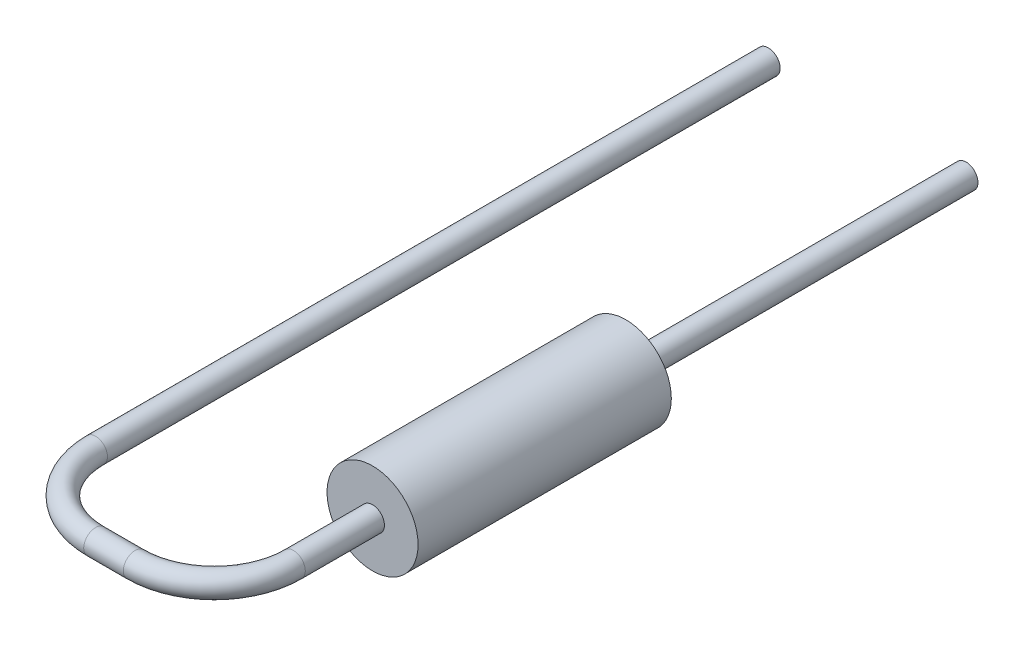
ISO-10303-21;
HEADER;
FILE_DESCRIPTION(('STEP AP214'),'2;1');
FILE_NAME('part.step','',(''),(''),'','','');
FILE_SCHEMA(('AUTOMOTIVE_DESIGN { 1 0 10303 214 1 1 1 1 }'));
ENDSEC;
DATA;
#1=APPLICATION_CONTEXT('core data for automotive mechanical design processes');
#2=APPLICATION_PROTOCOL_DEFINITION('international standard','automotive_design',2000,#1);
#3=PRODUCT_CONTEXT('',#1,'mechanical');
#4=PRODUCT('Part','Part','',(#3));
#5=PRODUCT_RELATED_PRODUCT_CATEGORY('part','',(#4));
#6=PRODUCT_DEFINITION_FORMATION('','',#4);
#7=PRODUCT_DEFINITION_CONTEXT('part definition',#1,'design');
#8=PRODUCT_DEFINITION('design','',#6,#7);
#9=PRODUCT_DEFINITION_SHAPE('','',#8);
#10=(LENGTH_UNIT() NAMED_UNIT(*) SI_UNIT(.MILLI.,.METRE.));
#11=(NAMED_UNIT(*) PLANE_ANGLE_UNIT() SI_UNIT($,.RADIAN.));
#12=(NAMED_UNIT(*) SI_UNIT($,.STERADIAN.) SOLID_ANGLE_UNIT());
#13=UNCERTAINTY_MEASURE_WITH_UNIT(LENGTH_MEASURE(1.E-05),#10,'distance_accuracy_value','');
#14=(GEOMETRIC_REPRESENTATION_CONTEXT(3) GLOBAL_UNCERTAINTY_ASSIGNED_CONTEXT((#13)) GLOBAL_UNIT_ASSIGNED_CONTEXT((#10,
#11,#12)) REPRESENTATION_CONTEXT('',''));
#15=CARTESIAN_POINT('',(0.,0.,0.));
#16=DIRECTION('',(0.,0.,1.));
#17=DIRECTION('',(1.,0.,0.));
#18=AXIS2_PLACEMENT_3D('',#15,#16,#17);
#19=CARTESIAN_POINT('',(0.,0.,0.));
#20=DIRECTION('',(0.,0.,1.));
#21=DIRECTION('',(1.,0.,0.));
#22=AXIS2_PLACEMENT_3D('',#19,#20,#21);
#23=PLANE('',#22);
#24=CARTESIAN_POINT('',(0.,0.,0.));
#25=DIRECTION('',(0.,0.,1.));
#26=DIRECTION('',(1.,0.,0.));
#27=AXIS2_PLACEMENT_3D('',#24,#25,#26);
#28=CIRCLE('',#27,1.15);
#29=CARTESIAN_POINT('',(1.15,0.,0.));
#30=VERTEX_POINT('',#29);
#31=EDGE_CURVE('E47',#30,#30,#28,.T.);
#32=ORIENTED_EDGE('',*,*,#31,.F.);
#33=EDGE_LOOP('',(#32));
#34=FACE_BOUND('',#33,.T.);
#35=CARTESIAN_POINT('',(0.,0.,0.));
#36=DIRECTION('',(0.,0.,1.));
#37=DIRECTION('',(1.,0.,0.));
#38=AXIS2_PLACEMENT_3D('',#35,#36,#37);
#39=CIRCLE('',#38,0.3);
#40=CARTESIAN_POINT('',(0.3,0.,0.));
#41=VERTEX_POINT('',#40);
#42=EDGE_CURVE('E10',#41,#41,#39,.F.);
#43=ORIENTED_EDGE('',*,*,#42,.F.);
#44=EDGE_LOOP('',(#43));
#45=FACE_BOUND('',#44,.T.);
#46=ADVANCED_FACE('F31',(#34,#45),#23,.F.);
#47=CARTESIAN_POINT('',(0.,0.,6.4));
#48=DIRECTION('',(0.,0.,-1.));
#49=DIRECTION('',(-1.,0.,0.));
#50=AXIS2_PLACEMENT_3D('',#47,#48,#49);
#51=CYLINDRICAL_SURFACE('',#50,1.15);
#52=CARTESIAN_POINT('',(0.,0.,6.4));
#53=DIRECTION('',(0.,0.,1.));
#54=DIRECTION('',(1.,0.,0.));
#55=AXIS2_PLACEMENT_3D('',#52,#53,#54);
#56=CIRCLE('',#55,1.15);
#57=CARTESIAN_POINT('',(1.15,0.,6.4));
#58=VERTEX_POINT('',#57);
#59=EDGE_CURVE('E42',#58,#58,#56,.T.);
#60=ORIENTED_EDGE('',*,*,#59,.F.);
#61=EDGE_LOOP('',(#60));
#62=FACE_BOUND('',#61,.T.);
#63=ORIENTED_EDGE('',*,*,#31,.T.);
#64=EDGE_LOOP('',(#63));
#65=FACE_BOUND('',#64,.T.);
#66=ADVANCED_FACE('F33',(#62,#65),#51,.T.);
#67=CARTESIAN_POINT('',(0.,0.,6.4));
#68=DIRECTION('',(0.,0.,1.));
#69=DIRECTION('',(1.,0.,0.));
#70=AXIS2_PLACEMENT_3D('',#67,#68,#69);
#71=PLANE('',#70);
#72=CARTESIAN_POINT('',(0.,0.,6.4));
#73=DIRECTION('',(0.,0.,1.));
#74=DIRECTION('',(1.,0.,0.));
#75=AXIS2_PLACEMENT_3D('',#72,#73,#74);
#76=CIRCLE('',#75,0.3);
#77=CARTESIAN_POINT('',(0.3,0.,6.4));
#78=VERTEX_POINT('',#77);
#79=EDGE_CURVE('E38',#78,#78,#76,.T.);
#80=ORIENTED_EDGE('',*,*,#79,.F.);
#81=EDGE_LOOP('',(#80));
#82=FACE_BOUND('',#81,.T.);
#83=ORIENTED_EDGE('',*,*,#59,.T.);
#84=EDGE_LOOP('',(#83));
#85=FACE_BOUND('',#84,.T.);
#86=ADVANCED_FACE('F73',(#82,#85),#71,.T.);
#87=CARTESIAN_POINT('',(-5.,0.,8.39999999999998));
#88=DIRECTION('',(0.,0.,-1.));
#89=DIRECTION('',(-1.,0.,0.));
#90=AXIS2_PLACEMENT_3D('',#87,#88,#89);
#91=CYLINDRICAL_SURFACE('',#90,0.3);
#92=CARTESIAN_POINT('',(-5.,0.,8.39999999999998));
#93=DIRECTION('',(0.,0.,-1.));
#94=DIRECTION('',(-1.,0.,0.));
#95=AXIS2_PLACEMENT_3D('',#92,#93,#94);
#96=CIRCLE('',#95,0.3);
#97=CARTESIAN_POINT('',(-5.3,0.,8.39999999999998));
#98=VERTEX_POINT('',#97);
#99=EDGE_CURVE('E59',#98,#98,#96,.T.);
#100=ORIENTED_EDGE('',*,*,#99,.T.);
#101=EDGE_LOOP('',(#100));
#102=FACE_BOUND('',#101,.T.);
#103=CARTESIAN_POINT('',(-5.,0.,-8.6));
#104=DIRECTION('',(0.,0.,-1.));
#105=DIRECTION('',(-1.,0.,0.));
#106=AXIS2_PLACEMENT_3D('',#103,#104,#105);
#107=CIRCLE('',#106,0.3);
#108=CARTESIAN_POINT('',(-5.3,0.,-8.60000000000001));
#109=VERTEX_POINT('',#108);
#110=EDGE_CURVE('E62',#109,#109,#107,.T.);
#111=ORIENTED_EDGE('',*,*,#110,.F.);
#112=EDGE_LOOP('',(#111));
#113=FACE_BOUND('',#112,.T.);
#114=ADVANCED_FACE('F78',(#102,#113),#91,.T.);
#115=CARTESIAN_POINT('',(-3.,0.,8.4));
#116=DIRECTION('',(0.,-1.,0.));
#117=DIRECTION('',(0.,0.,-1.));
#118=AXIS2_PLACEMENT_3D('',#115,#116,#117);
#119=TOROIDAL_SURFACE('',#118,2.,0.3);
#120=CARTESIAN_POINT('',(-2.99999999999999,0.,10.4));
#121=DIRECTION('',(-1.,0.,0.));
#122=DIRECTION('',(0.,0.,1.));
#123=AXIS2_PLACEMENT_3D('',#120,#121,#122);
#124=CIRCLE('',#123,0.3);
#125=CARTESIAN_POINT('',(-2.99999999999999,0.,10.7));
#126=VERTEX_POINT('',#125);
#127=EDGE_CURVE('E56',#126,#126,#124,.T.);
#128=CARTESIAN_POINT('',(-3.,0.,8.4));
#129=DIRECTION('',(0.,-1.,0.));
#130=DIRECTION('',(0.,0.,-1.));
#131=AXIS2_PLACEMENT_3D('',#128,#129,#130);
#132=CIRCLE('',#131,2.3);
#133=EDGE_CURVE('',#126,#98,#132,.T.);
#134=ORIENTED_EDGE('',*,*,#127,.T.);
#135=ORIENTED_EDGE('',*,*,#99,.F.);
#136=ORIENTED_EDGE('',*,*,#133,.T.);
#137=ORIENTED_EDGE('',*,*,#133,.F.);
#138=EDGE_LOOP('',(#134,#136,#135,#137));
#139=FACE_BOUND('',#138,.T.);
#140=ADVANCED_FACE('F82',(#139),#119,.T.);
#141=CARTESIAN_POINT('',(-2.00000000000002,0.,10.4));
#142=DIRECTION('',(-1.,0.,0.));
#143=DIRECTION('',(0.,0.,1.));
#144=AXIS2_PLACEMENT_3D('',#141,#142,#143);
#145=CYLINDRICAL_SURFACE('',#144,0.3);
#146=CARTESIAN_POINT('',(-2.00000000000002,0.,10.4));
#147=DIRECTION('',(-1.,0.,0.));
#148=DIRECTION('',(0.,0.,1.));
#149=AXIS2_PLACEMENT_3D('',#146,#147,#148);
#150=CIRCLE('',#149,0.3);
#151=CARTESIAN_POINT('',(-2.00000000000002,0.,10.7));
#152=VERTEX_POINT('',#151);
#153=EDGE_CURVE('E53',#152,#152,#150,.T.);
#154=ORIENTED_EDGE('',*,*,#153,.T.);
#155=EDGE_LOOP('',(#154));
#156=FACE_BOUND('',#155,.T.);
#157=ORIENTED_EDGE('',*,*,#127,.F.);
#158=EDGE_LOOP('',(#157));
#159=FACE_BOUND('',#158,.T.);
#160=ADVANCED_FACE('F86',(#156,#159),#145,.T.);
#161=CARTESIAN_POINT('',(-2.,0.,8.4));
#162=DIRECTION('',(0.,-1.,0.));
#163=DIRECTION('',(0.,0.,-1.));
#164=AXIS2_PLACEMENT_3D('',#161,#162,#163);
#165=TOROIDAL_SURFACE('',#164,2.,0.3);
#166=CARTESIAN_POINT('',(0.,0.,8.39999999999999));
#167=DIRECTION('',(0.,0.,1.));
#168=DIRECTION('',(1.,0.,0.));
#169=AXIS2_PLACEMENT_3D('',#166,#167,#168);
#170=CIRCLE('',#169,0.3);
#171=CARTESIAN_POINT('',(0.3,0.,8.39999999999999));
#172=VERTEX_POINT('',#171);
#173=EDGE_CURVE('E51',#172,#172,#170,.T.);
#174=CARTESIAN_POINT('',(-2.,0.,8.4));
#175=DIRECTION('',(0.,-1.,0.));
#176=DIRECTION('',(0.,0.,-1.));
#177=AXIS2_PLACEMENT_3D('',#174,#175,#176);
#178=CIRCLE('',#177,2.3);
#179=EDGE_CURVE('',#172,#152,#178,.T.);
#180=ORIENTED_EDGE('',*,*,#173,.T.);
#181=ORIENTED_EDGE('',*,*,#153,.F.);
#182=ORIENTED_EDGE('',*,*,#179,.T.);
#183=ORIENTED_EDGE('',*,*,#179,.F.);
#184=EDGE_LOOP('',(#180,#182,#181,#183));
#185=FACE_BOUND('',#184,.T.);
#186=ADVANCED_FACE('F90',(#185),#165,.T.);
#187=CARTESIAN_POINT('',(0.,0.,8.39999999999999));
#188=DIRECTION('',(0.,0.,-1.));
#189=DIRECTION('',(-1.,0.,0.));
#190=AXIS2_PLACEMENT_3D('',#187,#188,#189);
#191=CYLINDRICAL_SURFACE('',#190,0.3);
#192=ORIENTED_EDGE('',*,*,#173,.F.);
#193=EDGE_LOOP('',(#192));
#194=FACE_BOUND('',#193,.T.);
#195=ORIENTED_EDGE('',*,*,#79,.T.);
#196=EDGE_LOOP('',(#195));
#197=FACE_BOUND('',#196,.T.);
#198=ADVANCED_FACE('F94',(#194,#197),#191,.T.);
#199=CARTESIAN_POINT('',(-5.,0.,-8.6));
#200=DIRECTION('',(0.,0.,-1.));
#201=DIRECTION('',(-1.,0.,0.));
#202=AXIS2_PLACEMENT_3D('',#199,#200,#201);
#203=PLANE('',#202);
#204=ORIENTED_EDGE('',*,*,#110,.T.);
#205=EDGE_LOOP('',(#204));
#206=FACE_BOUND('',#205,.T.);
#207=ADVANCED_FACE('F98',(#206),#203,.T.);
#208=CARTESIAN_POINT('',(0.,0.,-9.44852813742372));
#209=DIRECTION('',(0.,0.,1.));
#210=DIRECTION('',(1.,0.,0.));
#211=AXIS2_PLACEMENT_3D('',#208,#209,#210);
#212=CYLINDRICAL_SURFACE('',#211,0.3);
#213=ORIENTED_EDGE('',*,*,#42,.T.);
#214=EDGE_LOOP('',(#213));
#215=FACE_BOUND('',#214,.T.);
#216=CARTESIAN_POINT('',(0.,0.,-8.59999999999986));
#217=DIRECTION('',(0.,0.,-1.));
#218=DIRECTION('',(-1.,0.,0.));
#219=AXIS2_PLACEMENT_3D('',#216,#217,#218);
#220=CIRCLE('',#219,0.3);
#221=CARTESIAN_POINT('',(-0.3,0.,-8.59999999999987));
#222=VERTEX_POINT('',#221);
#223=EDGE_CURVE('E114',#222,#222,#220,.T.);
#224=ORIENTED_EDGE('',*,*,#223,.F.);
#225=EDGE_LOOP('',(#224));
#226=FACE_BOUND('',#225,.T.);
#227=ADVANCED_FACE('F102',(#215,#226),#212,.T.);
#228=CARTESIAN_POINT('',(-5.,0.,-8.6));
#229=DIRECTION('',(0.,0.,-1.));
#230=DIRECTION('',(-1.,0.,0.));
#231=AXIS2_PLACEMENT_3D('',#228,#229,#230);
#232=PLANE('',#231);
#233=ORIENTED_EDGE('',*,*,#223,.T.);
#234=EDGE_LOOP('',(#233));
#235=FACE_BOUND('',#234,.T.);
#236=ADVANCED_FACE('F104',(#235),#232,.T.);
#237=CLOSED_SHELL('',(#46,#66,#86,#114,#140,#160,#186,#198,#207,#227,#236));
#238=MANIFOLD_SOLID_BREP('B2',#237);
#239=ADVANCED_BREP_SHAPE_REPRESENTATION('',(#18,#238),#14);
#240=SHAPE_DEFINITION_REPRESENTATION(#9,#239);
ENDSEC;
END-ISO-10303-21;
